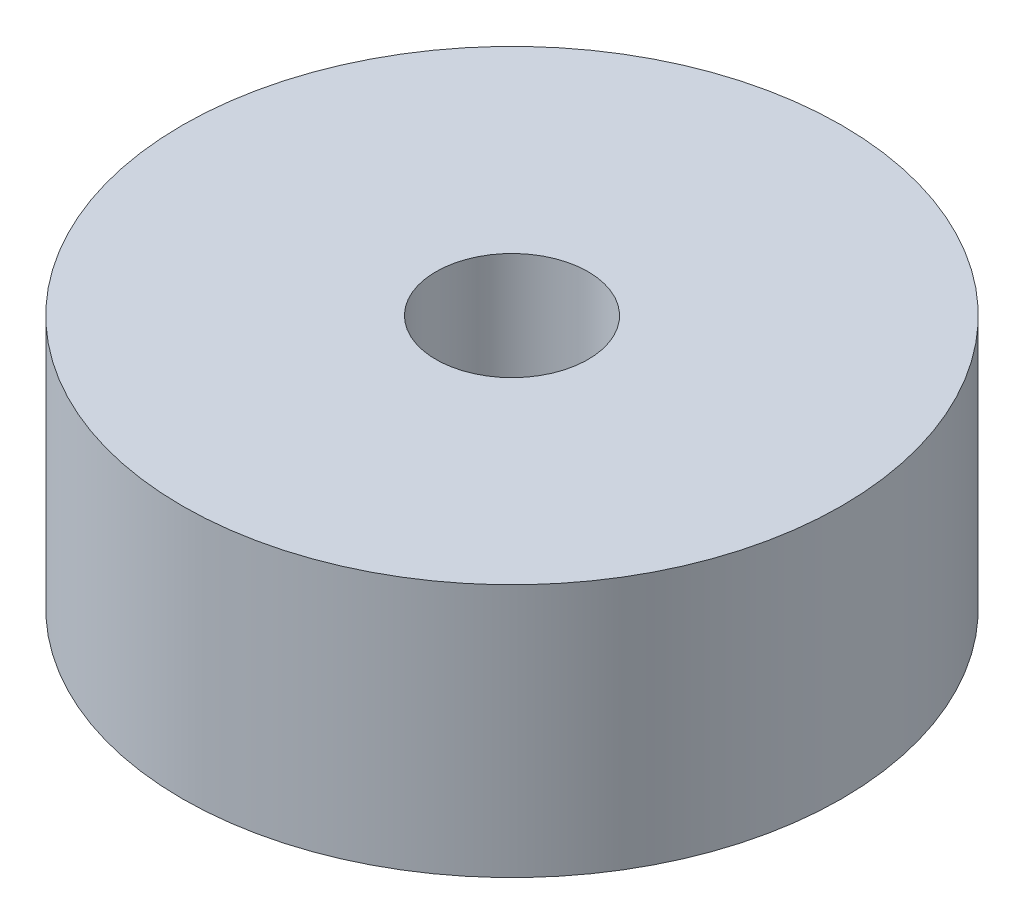
ISO-10303-21;
HEADER;
FILE_DESCRIPTION(('STEP AP214'),'2;1');
FILE_NAME('part.step','',(''),(''),'','','');
FILE_SCHEMA(('AUTOMOTIVE_DESIGN { 1 0 10303 214 1 1 1 1 }'));
ENDSEC;
DATA;
#1=APPLICATION_CONTEXT('core data for automotive mechanical design processes');
#2=APPLICATION_PROTOCOL_DEFINITION('international standard','automotive_design',2000,#1);
#3=PRODUCT_CONTEXT('',#1,'mechanical');
#4=PRODUCT('Part','Part','',(#3));
#5=PRODUCT_RELATED_PRODUCT_CATEGORY('part','',(#4));
#6=PRODUCT_DEFINITION_FORMATION('','',#4);
#7=PRODUCT_DEFINITION_CONTEXT('part definition',#1,'design');
#8=PRODUCT_DEFINITION('design','',#6,#7);
#9=PRODUCT_DEFINITION_SHAPE('','',#8);
#10=(LENGTH_UNIT() NAMED_UNIT(*) SI_UNIT(.MILLI.,.METRE.));
#11=(NAMED_UNIT(*) PLANE_ANGLE_UNIT() SI_UNIT($,.RADIAN.));
#12=(NAMED_UNIT(*) SI_UNIT($,.STERADIAN.) SOLID_ANGLE_UNIT());
#13=UNCERTAINTY_MEASURE_WITH_UNIT(LENGTH_MEASURE(1.E-05),#10,'distance_accuracy_value','');
#14=(GEOMETRIC_REPRESENTATION_CONTEXT(3) GLOBAL_UNCERTAINTY_ASSIGNED_CONTEXT((#13)) GLOBAL_UNIT_ASSIGNED_CONTEXT((#10,
#11,#12)) REPRESENTATION_CONTEXT('',''));
#15=CARTESIAN_POINT('',(0.,0.,0.));
#16=DIRECTION('',(0.,0.,1.));
#17=DIRECTION('',(1.,0.,0.));
#18=AXIS2_PLACEMENT_3D('',#15,#16,#17);
#19=CARTESIAN_POINT('',(0.,5.,0.));
#20=DIRECTION('',(0.,1.,0.));
#21=DIRECTION('',(0.,0.,-1.));
#22=AXIS2_PLACEMENT_3D('',#19,#20,#21);
#23=PLANE('',#22);
#24=CARTESIAN_POINT('',(0.,5.,0.));
#25=DIRECTION('',(0.,-1.,0.));
#26=DIRECTION('',(0.,0.,-1.));
#27=AXIS2_PLACEMENT_3D('',#24,#25,#26);
#28=CIRCLE('',#27,6.5);
#29=CARTESIAN_POINT('',(0.,5.,-6.5));
#30=VERTEX_POINT('',#29);
#31=EDGE_CURVE('E10',#30,#30,#28,.T.);
#32=ORIENTED_EDGE('',*,*,#31,.F.);
#33=EDGE_LOOP('',(#32));
#34=FACE_BOUND('',#33,.T.);
#35=CARTESIAN_POINT('',(0.,5.,0.));
#36=DIRECTION('',(0.,-1.,0.));
#37=DIRECTION('',(0.,0.,-1.));
#38=AXIS2_PLACEMENT_3D('',#35,#36,#37);
#39=CIRCLE('',#38,1.5);
#40=CARTESIAN_POINT('',(0.,5.,-1.5));
#41=VERTEX_POINT('',#40);
#42=EDGE_CURVE('E46',#41,#41,#39,.T.);
#43=ORIENTED_EDGE('',*,*,#42,.T.);
#44=EDGE_LOOP('',(#43));
#45=FACE_BOUND('',#44,.T.);
#46=ADVANCED_FACE('F35',(#34,#45),#23,.T.);
#47=CARTESIAN_POINT('',(0.,0.,0.));
#48=DIRECTION('',(0.,1.,0.));
#49=DIRECTION('',(0.,0.,-1.));
#50=AXIS2_PLACEMENT_3D('',#47,#48,#49);
#51=PLANE('',#50);
#52=CARTESIAN_POINT('',(0.,0.,0.));
#53=DIRECTION('',(0.,-1.,0.));
#54=DIRECTION('',(0.,0.,-1.));
#55=AXIS2_PLACEMENT_3D('',#52,#53,#54);
#56=CIRCLE('',#55,6.5);
#57=CARTESIAN_POINT('',(0.,0.,-6.5));
#58=VERTEX_POINT('',#57);
#59=EDGE_CURVE('E39',#58,#58,#56,.T.);
#60=ORIENTED_EDGE('',*,*,#59,.T.);
#61=EDGE_LOOP('',(#60));
#62=FACE_BOUND('',#61,.T.);
#63=CARTESIAN_POINT('',(0.,0.,0.));
#64=DIRECTION('',(0.,-1.,0.));
#65=DIRECTION('',(0.,0.,-1.));
#66=AXIS2_PLACEMENT_3D('',#63,#64,#65);
#67=CIRCLE('',#66,1.5);
#68=CARTESIAN_POINT('',(0.,0.,-1.5));
#69=VERTEX_POINT('',#68);
#70=EDGE_CURVE('E48',#69,#69,#67,.T.);
#71=ORIENTED_EDGE('',*,*,#70,.F.);
#72=EDGE_LOOP('',(#71));
#73=FACE_BOUND('',#72,.T.);
#74=ADVANCED_FACE('F61',(#62,#73),#51,.F.);
#75=CARTESIAN_POINT('',(0.,5.,0.));
#76=DIRECTION('',(0.,-1.,0.));
#77=DIRECTION('',(0.,0.,1.));
#78=AXIS2_PLACEMENT_3D('',#75,#76,#77);
#79=CYLINDRICAL_SURFACE('',#78,6.5);
#80=ORIENTED_EDGE('',*,*,#31,.T.);
#81=EDGE_LOOP('',(#80));
#82=FACE_BOUND('',#81,.T.);
#83=ORIENTED_EDGE('',*,*,#59,.F.);
#84=EDGE_LOOP('',(#83));
#85=FACE_BOUND('',#84,.T.);
#86=ADVANCED_FACE('F37',(#82,#85),#79,.T.);
#87=CARTESIAN_POINT('',(0.,5.,0.));
#88=DIRECTION('',(0.,-1.,0.));
#89=DIRECTION('',(0.,0.,1.));
#90=AXIS2_PLACEMENT_3D('',#87,#88,#89);
#91=CYLINDRICAL_SURFACE('',#90,1.5);
#92=ORIENTED_EDGE('',*,*,#42,.F.);
#93=EDGE_LOOP('',(#92));
#94=FACE_BOUND('',#93,.T.);
#95=ORIENTED_EDGE('',*,*,#70,.T.);
#96=EDGE_LOOP('',(#95));
#97=FACE_BOUND('',#96,.T.);
#98=ADVANCED_FACE('F55',(#94,#97),#91,.F.);
#99=CLOSED_SHELL('',(#46,#74,#86,#98));
#100=MANIFOLD_SOLID_BREP('B2',#99);
#101=ADVANCED_BREP_SHAPE_REPRESENTATION('',(#18,#100),#14);
#102=SHAPE_DEFINITION_REPRESENTATION(#9,#101);
ENDSEC;
END-ISO-10303-21;
